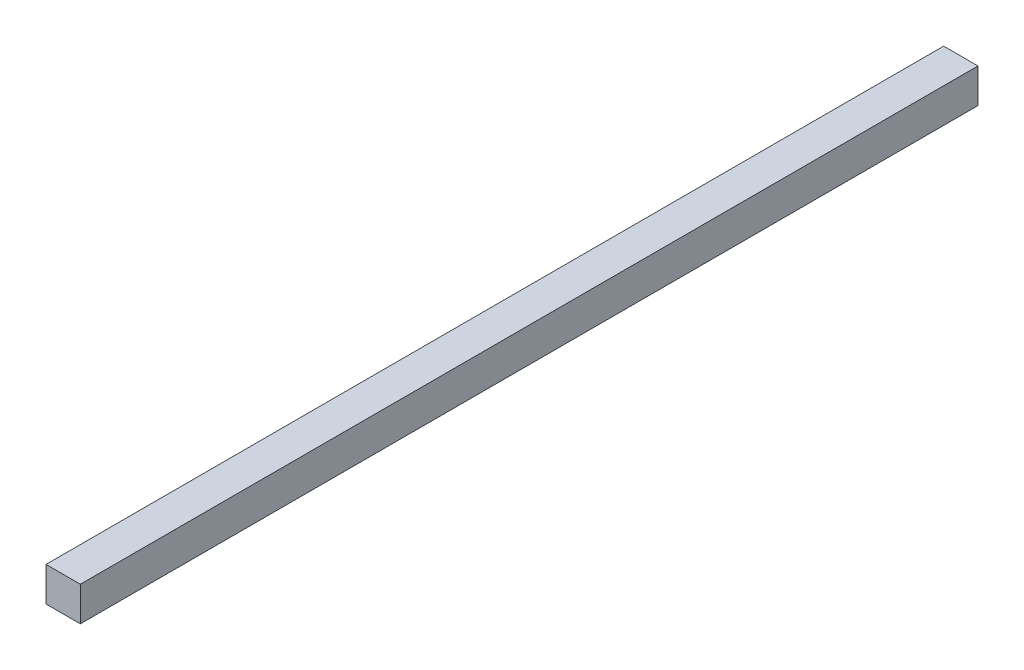
ISO-10303-21;
HEADER;
FILE_DESCRIPTION(('STEP AP214'),'2;1');
FILE_NAME('part.step','',(''),(''),'','','');
FILE_SCHEMA(('AUTOMOTIVE_DESIGN { 1 0 10303 214 1 1 1 1 }'));
ENDSEC;
DATA;
#1=APPLICATION_CONTEXT('core data for automotive mechanical design processes');
#2=APPLICATION_PROTOCOL_DEFINITION('international standard','automotive_design',2000,#1);
#3=PRODUCT_CONTEXT('',#1,'mechanical');
#4=PRODUCT('Part','Part','',(#3));
#5=PRODUCT_RELATED_PRODUCT_CATEGORY('part','',(#4));
#6=PRODUCT_DEFINITION_FORMATION('','',#4);
#7=PRODUCT_DEFINITION_CONTEXT('part definition',#1,'design');
#8=PRODUCT_DEFINITION('design','',#6,#7);
#9=PRODUCT_DEFINITION_SHAPE('','',#8);
#10=(LENGTH_UNIT() NAMED_UNIT(*) SI_UNIT(.MILLI.,.METRE.));
#11=(NAMED_UNIT(*) PLANE_ANGLE_UNIT() SI_UNIT($,.RADIAN.));
#12=(NAMED_UNIT(*) SI_UNIT($,.STERADIAN.) SOLID_ANGLE_UNIT());
#13=UNCERTAINTY_MEASURE_WITH_UNIT(LENGTH_MEASURE(1.E-05),#10,'distance_accuracy_value','');
#14=(GEOMETRIC_REPRESENTATION_CONTEXT(3) GLOBAL_UNCERTAINTY_ASSIGNED_CONTEXT((#13)) GLOBAL_UNIT_ASSIGNED_CONTEXT((#10,
#11,#12)) REPRESENTATION_CONTEXT('',''));
#15=CARTESIAN_POINT('',(0.,0.,0.));
#16=DIRECTION('',(0.,0.,1.));
#17=DIRECTION('',(1.,0.,0.));
#18=AXIS2_PLACEMENT_3D('',#15,#16,#17);
#19=CARTESIAN_POINT('',(10.,-10.,523.));
#20=DIRECTION('',(-1.,0.,0.));
#21=DIRECTION('',(0.,0.,1.));
#22=AXIS2_PLACEMENT_3D('',#19,#20,#21);
#23=PLANE('',#22);
#24=DIRECTION('',(0.,1.,0.));
#25=VECTOR('',#24,1.);
#26=CARTESIAN_POINT('',(10.,-10.,0.));
#27=LINE('',#26,#25);
#28=CARTESIAN_POINT('',(10.,-10.,0.));
#29=VERTEX_POINT('',#28);
#30=CARTESIAN_POINT('',(10.,10.,0.));
#31=VERTEX_POINT('',#30);
#32=EDGE_CURVE('E98',#29,#31,#27,.T.);
#33=ORIENTED_EDGE('',*,*,#32,.T.);
#34=DIRECTION('',(0.,0.,-1.));
#35=VECTOR('',#34,1.);
#36=CARTESIAN_POINT('',(10.,10.,523.));
#37=LINE('',#36,#35);
#38=CARTESIAN_POINT('',(10.,10.,523.));
#39=VERTEX_POINT('',#38);
#40=EDGE_CURVE('E11',#39,#31,#37,.T.);
#41=ORIENTED_EDGE('',*,*,#40,.F.);
#42=DIRECTION('',(0.,1.,0.));
#43=VECTOR('',#42,1.);
#44=CARTESIAN_POINT('',(10.,-10.,523.));
#45=LINE('',#44,#43);
#46=CARTESIAN_POINT('',(10.,-10.,523.));
#47=VERTEX_POINT('',#46);
#48=EDGE_CURVE('E86',#47,#39,#45,.T.);
#49=ORIENTED_EDGE('',*,*,#48,.F.);
#50=DIRECTION('',(0.,0.,-1.));
#51=VECTOR('',#50,1.);
#52=CARTESIAN_POINT('',(10.,-10.,523.));
#53=LINE('',#52,#51);
#54=EDGE_CURVE('E94',#47,#29,#53,.T.);
#55=ORIENTED_EDGE('',*,*,#54,.T.);
#56=EDGE_LOOP('',(#33,#41,#49,#55));
#57=FACE_BOUND('',#56,.T.);
#58=ADVANCED_FACE('F35',(#57),#23,.F.);
#59=CARTESIAN_POINT('',(-10.,10.,523.));
#60=DIRECTION('',(0.,-1.,0.));
#61=DIRECTION('',(0.,0.,-1.));
#62=AXIS2_PLACEMENT_3D('',#59,#60,#61);
#63=PLANE('',#62);
#64=DIRECTION('',(-1.,0.,0.));
#65=VECTOR('',#64,1.);
#66=CARTESIAN_POINT('',(-10.,10.,0.));
#67=LINE('',#66,#65);
#68=CARTESIAN_POINT('',(-10.,10.,0.));
#69=VERTEX_POINT('',#68);
#70=EDGE_CURVE('E90',#31,#69,#67,.T.);
#71=ORIENTED_EDGE('',*,*,#70,.T.);
#72=DIRECTION('',(0.,0.,-1.));
#73=VECTOR('',#72,1.);
#74=CARTESIAN_POINT('',(-10.,10.,523.));
#75=LINE('',#74,#73);
#76=CARTESIAN_POINT('',(-10.,10.,523.));
#77=VERTEX_POINT('',#76);
#78=EDGE_CURVE('E43',#77,#69,#75,.T.);
#79=ORIENTED_EDGE('',*,*,#78,.F.);
#80=DIRECTION('',(-1.,0.,0.));
#81=VECTOR('',#80,1.);
#82=CARTESIAN_POINT('',(-10.,10.,523.));
#83=LINE('',#82,#81);
#84=EDGE_CURVE('E81',#39,#77,#83,.T.);
#85=ORIENTED_EDGE('',*,*,#84,.F.);
#86=ORIENTED_EDGE('',*,*,#40,.T.);
#87=EDGE_LOOP('',(#71,#79,#85,#86));
#88=FACE_BOUND('',#87,.T.);
#89=ADVANCED_FACE('F89',(#88),#63,.F.);
#90=CARTESIAN_POINT('',(-10.,-10.,523.));
#91=DIRECTION('',(1.,0.,0.));
#92=DIRECTION('',(0.,0.,-1.));
#93=AXIS2_PLACEMENT_3D('',#90,#91,#92);
#94=PLANE('',#93);
#95=DIRECTION('',(0.,-1.,0.));
#96=VECTOR('',#95,1.);
#97=CARTESIAN_POINT('',(-10.,-10.,0.));
#98=LINE('',#97,#96);
#99=CARTESIAN_POINT('',(-10.,-10.,0.));
#100=VERTEX_POINT('',#99);
#101=EDGE_CURVE('E68',#69,#100,#98,.T.);
#102=ORIENTED_EDGE('',*,*,#101,.T.);
#103=DIRECTION('',(0.,0.,-1.));
#104=VECTOR('',#103,1.);
#105=CARTESIAN_POINT('',(-10.,-10.,523.));
#106=LINE('',#105,#104);
#107=CARTESIAN_POINT('',(-10.,-10.,523.));
#108=VERTEX_POINT('',#107);
#109=EDGE_CURVE('E91',#108,#100,#106,.T.);
#110=ORIENTED_EDGE('',*,*,#109,.F.);
#111=DIRECTION('',(0.,-1.,0.));
#112=VECTOR('',#111,1.);
#113=CARTESIAN_POINT('',(-10.,-10.,523.));
#114=LINE('',#113,#112);
#115=EDGE_CURVE('E84',#77,#108,#114,.T.);
#116=ORIENTED_EDGE('',*,*,#115,.F.);
#117=ORIENTED_EDGE('',*,*,#78,.T.);
#118=EDGE_LOOP('',(#102,#110,#116,#117));
#119=FACE_BOUND('',#118,.T.);
#120=ADVANCED_FACE('F92',(#119),#94,.F.);
#121=CARTESIAN_POINT('',(-10.,-10.,523.));
#122=DIRECTION('',(0.,1.,0.));
#123=DIRECTION('',(0.,0.,1.));
#124=AXIS2_PLACEMENT_3D('',#121,#122,#123);
#125=PLANE('',#124);
#126=DIRECTION('',(1.,0.,0.));
#127=VECTOR('',#126,1.);
#128=CARTESIAN_POINT('',(-10.,-10.,0.));
#129=LINE('',#128,#127);
#130=EDGE_CURVE('E74',#100,#29,#129,.T.);
#131=ORIENTED_EDGE('',*,*,#130,.T.);
#132=ORIENTED_EDGE('',*,*,#54,.F.);
#133=DIRECTION('',(1.,0.,0.));
#134=VECTOR('',#133,1.);
#135=CARTESIAN_POINT('',(-10.,-10.,523.));
#136=LINE('',#135,#134);
#137=EDGE_CURVE('E51',#108,#47,#136,.T.);
#138=ORIENTED_EDGE('',*,*,#137,.F.);
#139=ORIENTED_EDGE('',*,*,#109,.T.);
#140=EDGE_LOOP('',(#131,#132,#138,#139));
#141=FACE_BOUND('',#140,.T.);
#142=ADVANCED_FACE('F105',(#141),#125,.F.);
#143=CARTESIAN_POINT('',(0.,0.,523.));
#144=DIRECTION('',(0.,0.,-1.));
#145=DIRECTION('',(-1.,0.,0.));
#146=AXIS2_PLACEMENT_3D('',#143,#144,#145);
#147=PLANE('',#146);
#148=ORIENTED_EDGE('',*,*,#48,.T.);
#149=ORIENTED_EDGE('',*,*,#84,.T.);
#150=ORIENTED_EDGE('',*,*,#115,.T.);
#151=ORIENTED_EDGE('',*,*,#137,.T.);
#152=EDGE_LOOP('',(#148,#149,#150,#151));
#153=FACE_BOUND('',#152,.T.);
#154=ADVANCED_FACE('F82',(#153),#147,.F.);
#155=CARTESIAN_POINT('',(0.,0.,0.));
#156=DIRECTION('',(0.,0.,-1.));
#157=DIRECTION('',(-1.,0.,0.));
#158=AXIS2_PLACEMENT_3D('',#155,#156,#157);
#159=PLANE('',#158);
#160=ORIENTED_EDGE('',*,*,#32,.F.);
#161=ORIENTED_EDGE('',*,*,#130,.F.);
#162=ORIENTED_EDGE('',*,*,#101,.F.);
#163=ORIENTED_EDGE('',*,*,#70,.F.);
#164=EDGE_LOOP('',(#160,#161,#162,#163));
#165=FACE_BOUND('',#164,.T.);
#166=ADVANCED_FACE('F108',(#165),#159,.T.);
#167=CLOSED_SHELL('',(#58,#89,#120,#142,#154,#166));
#168=MANIFOLD_SOLID_BREP('B2',#167);
#169=ADVANCED_BREP_SHAPE_REPRESENTATION('',(#18,#168),#14);
#170=SHAPE_DEFINITION_REPRESENTATION(#9,#169);
ENDSEC;
END-ISO-10303-21;
